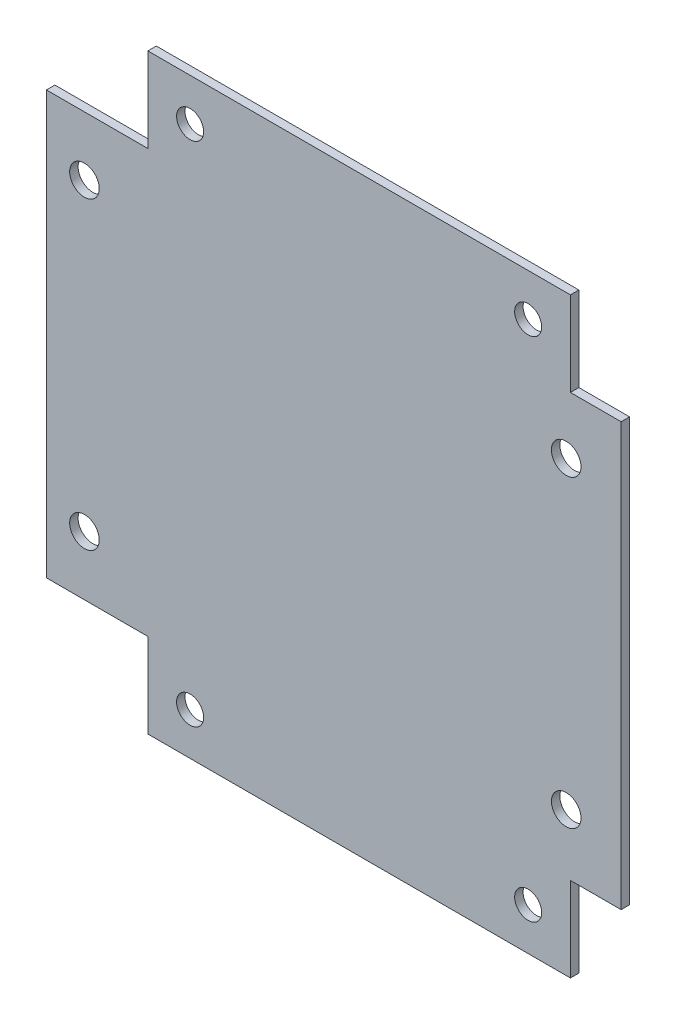
ISO-10303-21;
HEADER;
FILE_DESCRIPTION(('STEP AP214'),'2;1');
FILE_NAME('part.step','',(''),(''),'','','');
FILE_SCHEMA(('AUTOMOTIVE_DESIGN { 1 0 10303 214 1 1 1 1 }'));
ENDSEC;
DATA;
#1=APPLICATION_CONTEXT('core data for automotive mechanical design processes');
#2=APPLICATION_PROTOCOL_DEFINITION('international standard','automotive_design',2000,#1);
#3=PRODUCT_CONTEXT('',#1,'mechanical');
#4=PRODUCT('Part','Part','',(#3));
#5=PRODUCT_RELATED_PRODUCT_CATEGORY('part','',(#4));
#6=PRODUCT_DEFINITION_FORMATION('','',#4);
#7=PRODUCT_DEFINITION_CONTEXT('part definition',#1,'design');
#8=PRODUCT_DEFINITION('design','',#6,#7);
#9=PRODUCT_DEFINITION_SHAPE('','',#8);
#10=(LENGTH_UNIT() NAMED_UNIT(*) SI_UNIT(.MILLI.,.METRE.));
#11=(NAMED_UNIT(*) PLANE_ANGLE_UNIT() SI_UNIT($,.RADIAN.));
#12=(NAMED_UNIT(*) SI_UNIT($,.STERADIAN.) SOLID_ANGLE_UNIT());
#13=UNCERTAINTY_MEASURE_WITH_UNIT(LENGTH_MEASURE(1.E-05),#10,'distance_accuracy_value','');
#14=(GEOMETRIC_REPRESENTATION_CONTEXT(3) GLOBAL_UNCERTAINTY_ASSIGNED_CONTEXT((#13)) GLOBAL_UNIT_ASSIGNED_CONTEXT((#10,
#11,#12)) REPRESENTATION_CONTEXT('',''));
#15=CARTESIAN_POINT('',(0.,0.,0.));
#16=DIRECTION('',(0.,0.,1.));
#17=DIRECTION('',(1.,0.,0.));
#18=AXIS2_PLACEMENT_3D('',#15,#16,#17);
#19=CARTESIAN_POINT('',(28.,0.,1.));
#20=DIRECTION('',(0.,0.,1.));
#21=DIRECTION('',(1.,0.,0.));
#22=AXIS2_PLACEMENT_3D('',#19,#20,#21);
#23=PLANE('',#22);
#24=CARTESIAN_POINT('',(-20.,30.,1.));
#25=DIRECTION('',(0.,0.,1.));
#26=DIRECTION('',(1.,0.,0.));
#27=AXIS2_PLACEMENT_3D('',#24,#25,#26);
#28=CIRCLE('',#27,1.6);
#29=CARTESIAN_POINT('',(-18.4,30.,1.));
#30=VERTEX_POINT('',#29);
#31=EDGE_CURVE('E153',#30,#30,#28,.F.);
#32=ORIENTED_EDGE('',*,*,#31,.T.);
#33=EDGE_LOOP('',(#32));
#34=FACE_BOUND('',#33,.T.);
#35=CARTESIAN_POINT('',(20.,30.,1.));
#36=DIRECTION('',(0.,0.,1.));
#37=DIRECTION('',(1.,0.,0.));
#38=AXIS2_PLACEMENT_3D('',#35,#36,#37);
#39=CIRCLE('',#38,1.6);
#40=CARTESIAN_POINT('',(21.6,30.,1.));
#41=VERTEX_POINT('',#40);
#42=EDGE_CURVE('E156',#41,#41,#39,.F.);
#43=ORIENTED_EDGE('',*,*,#42,.T.);
#44=EDGE_LOOP('',(#43));
#45=FACE_BOUND('',#44,.T.);
#46=CARTESIAN_POINT('',(-20.,-30.,1.));
#47=DIRECTION('',(0.,0.,1.));
#48=DIRECTION('',(1.,0.,0.));
#49=AXIS2_PLACEMENT_3D('',#46,#47,#48);
#50=CIRCLE('',#49,1.6);
#51=CARTESIAN_POINT('',(-18.4,-30.,1.));
#52=VERTEX_POINT('',#51);
#53=EDGE_CURVE('E159',#52,#52,#50,.F.);
#54=ORIENTED_EDGE('',*,*,#53,.T.);
#55=EDGE_LOOP('',(#54));
#56=FACE_BOUND('',#55,.T.);
#57=CARTESIAN_POINT('',(20.,-30.,1.));
#58=DIRECTION('',(0.,0.,1.));
#59=DIRECTION('',(1.,0.,0.));
#60=AXIS2_PLACEMENT_3D('',#57,#58,#59);
#61=CIRCLE('',#60,1.6);
#62=CARTESIAN_POINT('',(21.6,-30.,1.));
#63=VERTEX_POINT('',#62);
#64=EDGE_CURVE('E162',#63,#63,#61,.F.);
#65=ORIENTED_EDGE('',*,*,#64,.T.);
#66=EDGE_LOOP('',(#65));
#67=FACE_BOUND('',#66,.T.);
#68=CARTESIAN_POINT('',(-32.5,-18.,1.));
#69=DIRECTION('',(0.,0.,-1.));
#70=DIRECTION('',(-1.,0.,0.));
#71=AXIS2_PLACEMENT_3D('',#68,#69,#70);
#72=CIRCLE('',#71,1.75);
#73=CARTESIAN_POINT('',(-34.25,-18.,1.));
#74=VERTEX_POINT('',#73);
#75=EDGE_CURVE('E165',#74,#74,#72,.T.);
#76=ORIENTED_EDGE('',*,*,#75,.T.);
#77=EDGE_LOOP('',(#76));
#78=FACE_BOUND('',#77,.T.);
#79=CARTESIAN_POINT('',(24.5,18.,1.));
#80=DIRECTION('',(0.,0.,-1.));
#81=DIRECTION('',(-1.,0.,0.));
#82=AXIS2_PLACEMENT_3D('',#79,#80,#81);
#83=CIRCLE('',#82,1.75);
#84=CARTESIAN_POINT('',(22.75,18.,1.));
#85=VERTEX_POINT('',#84);
#86=EDGE_CURVE('E168',#85,#85,#83,.T.);
#87=ORIENTED_EDGE('',*,*,#86,.T.);
#88=EDGE_LOOP('',(#87));
#89=FACE_BOUND('',#88,.T.);
#90=CARTESIAN_POINT('',(-32.5,18.,1.));
#91=DIRECTION('',(0.,0.,-1.));
#92=DIRECTION('',(-1.,0.,0.));
#93=AXIS2_PLACEMENT_3D('',#90,#91,#92);
#94=CIRCLE('',#93,1.75);
#95=CARTESIAN_POINT('',(-34.25,18.,1.));
#96=VERTEX_POINT('',#95);
#97=EDGE_CURVE('E170',#96,#96,#94,.T.);
#98=ORIENTED_EDGE('',*,*,#97,.T.);
#99=EDGE_LOOP('',(#98));
#100=FACE_BOUND('',#99,.T.);
#101=CARTESIAN_POINT('',(24.5,-18.,1.));
#102=DIRECTION('',(0.,0.,-1.));
#103=DIRECTION('',(-1.,0.,0.));
#104=AXIS2_PLACEMENT_3D('',#101,#102,#103);
#105=CIRCLE('',#104,1.75);
#106=CARTESIAN_POINT('',(22.75,-18.,1.));
#107=VERTEX_POINT('',#106);
#108=EDGE_CURVE('E19',#107,#107,#105,.T.);
#109=ORIENTED_EDGE('',*,*,#108,.T.);
#110=EDGE_LOOP('',(#109));
#111=FACE_BOUND('',#110,.T.);
#112=DIRECTION('',(1.,0.,0.));
#113=VECTOR('',#112,1.);
#114=CARTESIAN_POINT('',(25.,-35.,1.));
#115=LINE('',#114,#113);
#116=CARTESIAN_POINT('',(25.,-35.,1.));
#117=VERTEX_POINT('',#116);
#118=CARTESIAN_POINT('',(-25.,-35.,1.));
#119=VERTEX_POINT('',#118);
#120=EDGE_CURVE('E194',#117,#119,#115,.F.);
#121=ORIENTED_EDGE('',*,*,#120,.F.);
#122=DIRECTION('',(0.,1.,0.));
#123=VECTOR('',#122,1.);
#124=CARTESIAN_POINT('',(25.,35.,1.));
#125=LINE('',#124,#123);
#126=CARTESIAN_POINT('',(25.,-25.,1.));
#127=VERTEX_POINT('',#126);
#128=EDGE_CURVE('E190',#127,#117,#125,.F.);
#129=ORIENTED_EDGE('',*,*,#128,.F.);
#130=DIRECTION('',(1.,0.,0.));
#131=VECTOR('',#130,1.);
#132=CARTESIAN_POINT('',(31.,-25.,1.));
#133=LINE('',#132,#131);
#134=CARTESIAN_POINT('',(31.,-25.,1.));
#135=VERTEX_POINT('',#134);
#136=EDGE_CURVE('E186',#135,#127,#133,.F.);
#137=ORIENTED_EDGE('',*,*,#136,.F.);
#138=DIRECTION('',(0.,1.,0.));
#139=VECTOR('',#138,1.);
#140=CARTESIAN_POINT('',(31.,25.,1.));
#141=LINE('',#140,#139);
#142=CARTESIAN_POINT('',(31.,25.,1.));
#143=VERTEX_POINT('',#142);
#144=EDGE_CURVE('E113',#143,#135,#141,.F.);
#145=ORIENTED_EDGE('',*,*,#144,.F.);
#146=DIRECTION('',(1.,0.,0.));
#147=VECTOR('',#146,1.);
#148=CARTESIAN_POINT('',(25.,25.,1.));
#149=LINE('',#148,#147);
#150=CARTESIAN_POINT('',(25.,25.,1.));
#151=VERTEX_POINT('',#150);
#152=EDGE_CURVE('E107',#151,#143,#149,.T.);
#153=ORIENTED_EDGE('',*,*,#152,.F.);
#154=DIRECTION('',(0.,1.,0.));
#155=VECTOR('',#154,1.);
#156=CARTESIAN_POINT('',(25.,35.,1.));
#157=LINE('',#156,#155);
#158=CARTESIAN_POINT('',(25.,35.,1.));
#159=VERTEX_POINT('',#158);
#160=EDGE_CURVE('E110',#159,#151,#157,.F.);
#161=ORIENTED_EDGE('',*,*,#160,.F.);
#162=DIRECTION('',(1.,0.,0.));
#163=VECTOR('',#162,1.);
#164=CARTESIAN_POINT('',(-25.,35.,1.));
#165=LINE('',#164,#163);
#166=CARTESIAN_POINT('',(-25.,35.,1.));
#167=VERTEX_POINT('',#166);
#168=EDGE_CURVE('E102',#167,#159,#165,.T.);
#169=ORIENTED_EDGE('',*,*,#168,.F.);
#170=DIRECTION('',(0.,-1.,0.));
#171=VECTOR('',#170,1.);
#172=CARTESIAN_POINT('',(-25.,-25.,1.));
#173=LINE('',#172,#171);
#174=CARTESIAN_POINT('',(-25.,25.,1.));
#175=VERTEX_POINT('',#174);
#176=EDGE_CURVE('E215',#175,#167,#173,.F.);
#177=ORIENTED_EDGE('',*,*,#176,.F.);
#178=DIRECTION('',(1.,0.,0.));
#179=VECTOR('',#178,1.);
#180=CARTESIAN_POINT('',(-37.,25.,1.));
#181=LINE('',#180,#179);
#182=CARTESIAN_POINT('',(-37.,25.,1.));
#183=VERTEX_POINT('',#182);
#184=EDGE_CURVE('E211',#183,#175,#181,.T.);
#185=ORIENTED_EDGE('',*,*,#184,.F.);
#186=DIRECTION('',(0.,-1.,0.));
#187=VECTOR('',#186,1.);
#188=CARTESIAN_POINT('',(-37.,-25.,1.));
#189=LINE('',#188,#187);
#190=CARTESIAN_POINT('',(-37.,-25.,1.));
#191=VERTEX_POINT('',#190);
#192=EDGE_CURVE('E207',#191,#183,#189,.F.);
#193=ORIENTED_EDGE('',*,*,#192,.F.);
#194=DIRECTION('',(1.,0.,0.));
#195=VECTOR('',#194,1.);
#196=CARTESIAN_POINT('',(-25.,-25.,1.));
#197=LINE('',#196,#195);
#198=CARTESIAN_POINT('',(-25.,-25.,1.));
#199=VERTEX_POINT('',#198);
#200=EDGE_CURVE('E203',#199,#191,#197,.F.);
#201=ORIENTED_EDGE('',*,*,#200,.F.);
#202=DIRECTION('',(0.,-1.,0.));
#203=VECTOR('',#202,1.);
#204=CARTESIAN_POINT('',(-25.,-25.,1.));
#205=LINE('',#204,#203);
#206=EDGE_CURVE('E196',#119,#199,#205,.F.);
#207=ORIENTED_EDGE('',*,*,#206,.F.);
#208=EDGE_LOOP('',(#121,#129,#137,#145,#153,#161,#169,#177,#185,#193,#201,#207));
#209=FACE_BOUND('',#208,.T.);
#210=ADVANCED_FACE('F16',(#34,#45,#56,#67,#78,#89,#100,#111,#209),#23,.T.);
#211=CARTESIAN_POINT('',(25.,25.,0.));
#212=DIRECTION('',(0.,1.,0.));
#213=DIRECTION('',(0.,0.,1.));
#214=AXIS2_PLACEMENT_3D('',#211,#212,#213);
#215=PLANE('',#214);
#216=DIRECTION('',(1.,0.,0.));
#217=VECTOR('',#216,1.);
#218=CARTESIAN_POINT('',(28.,25.,0.));
#219=LINE('',#218,#217);
#220=CARTESIAN_POINT('',(31.,25.,0.));
#221=VERTEX_POINT('',#220);
#222=CARTESIAN_POINT('',(25.,25.,0.));
#223=VERTEX_POINT('',#222);
#224=EDGE_CURVE('E128',#221,#223,#219,.F.);
#225=ORIENTED_EDGE('',*,*,#224,.T.);
#226=DIRECTION('',(0.,0.,1.));
#227=VECTOR('',#226,1.);
#228=CARTESIAN_POINT('',(25.,25.,0.));
#229=LINE('',#228,#227);
#230=EDGE_CURVE('E118',#151,#223,#229,.F.);
#231=ORIENTED_EDGE('',*,*,#230,.F.);
#232=ORIENTED_EDGE('',*,*,#152,.T.);
#233=DIRECTION('',(0.,0.,1.));
#234=VECTOR('',#233,1.);
#235=CARTESIAN_POINT('',(31.,25.,0.));
#236=LINE('',#235,#234);
#237=EDGE_CURVE('E175',#221,#143,#236,.T.);
#238=ORIENTED_EDGE('',*,*,#237,.F.);
#239=EDGE_LOOP('',(#225,#231,#232,#238));
#240=FACE_BOUND('',#239,.T.);
#241=ADVANCED_FACE('F127',(#240),#215,.T.);
#242=CARTESIAN_POINT('',(25.,35.,0.));
#243=DIRECTION('',(1.,0.,0.));
#244=DIRECTION('',(0.,1.,0.));
#245=AXIS2_PLACEMENT_3D('',#242,#243,#244);
#246=PLANE('',#245);
#247=DIRECTION('',(0.,0.,1.));
#248=VECTOR('',#247,1.);
#249=CARTESIAN_POINT('',(25.,35.,0.));
#250=LINE('',#249,#248);
#251=CARTESIAN_POINT('',(25.,35.,0.));
#252=VERTEX_POINT('',#251);
#253=EDGE_CURVE('E124',#159,#252,#250,.F.);
#254=ORIENTED_EDGE('',*,*,#253,.F.);
#255=ORIENTED_EDGE('',*,*,#160,.T.);
#256=ORIENTED_EDGE('',*,*,#230,.T.);
#257=DIRECTION('',(0.,1.,0.));
#258=VECTOR('',#257,1.);
#259=CARTESIAN_POINT('',(25.,0.,0.));
#260=LINE('',#259,#258);
#261=EDGE_CURVE('E225',#223,#252,#260,.T.);
#262=ORIENTED_EDGE('',*,*,#261,.T.);
#263=EDGE_LOOP('',(#254,#255,#256,#262));
#264=FACE_BOUND('',#263,.T.);
#265=ADVANCED_FACE('F121',(#264),#246,.T.);
#266=CARTESIAN_POINT('',(-25.,35.,0.));
#267=DIRECTION('',(0.,1.,0.));
#268=DIRECTION('',(0.,0.,1.));
#269=AXIS2_PLACEMENT_3D('',#266,#267,#268);
#270=PLANE('',#269);
#271=DIRECTION('',(1.,0.,0.));
#272=VECTOR('',#271,1.);
#273=CARTESIAN_POINT('',(28.,35.,0.));
#274=LINE('',#273,#272);
#275=CARTESIAN_POINT('',(-25.,35.,0.));
#276=VERTEX_POINT('',#275);
#277=EDGE_CURVE('E220',#252,#276,#274,.F.);
#278=ORIENTED_EDGE('',*,*,#277,.T.);
#279=DIRECTION('',(0.,0.,1.));
#280=VECTOR('',#279,1.);
#281=CARTESIAN_POINT('',(-25.,35.,0.));
#282=LINE('',#281,#280);
#283=EDGE_CURVE('E213',#167,#276,#282,.F.);
#284=ORIENTED_EDGE('',*,*,#283,.F.);
#285=ORIENTED_EDGE('',*,*,#168,.T.);
#286=ORIENTED_EDGE('',*,*,#253,.T.);
#287=EDGE_LOOP('',(#278,#284,#285,#286));
#288=FACE_BOUND('',#287,.T.);
#289=ADVANCED_FACE('F219',(#288),#270,.T.);
#290=CARTESIAN_POINT('',(-25.,-25.,0.));
#291=DIRECTION('',(-1.,0.,0.));
#292=DIRECTION('',(0.,-1.,0.));
#293=AXIS2_PLACEMENT_3D('',#290,#291,#292);
#294=PLANE('',#293);
#295=ORIENTED_EDGE('',*,*,#283,.T.);
#296=DIRECTION('',(0.,1.,0.));
#297=VECTOR('',#296,1.);
#298=CARTESIAN_POINT('',(-25.,0.,0.));
#299=LINE('',#298,#297);
#300=CARTESIAN_POINT('',(-25.,25.,0.));
#301=VERTEX_POINT('',#300);
#302=EDGE_CURVE('E228',#276,#301,#299,.F.);
#303=ORIENTED_EDGE('',*,*,#302,.T.);
#304=DIRECTION('',(0.,0.,1.));
#305=VECTOR('',#304,1.);
#306=CARTESIAN_POINT('',(-25.,25.,0.));
#307=LINE('',#306,#305);
#308=EDGE_CURVE('E209',#175,#301,#307,.F.);
#309=ORIENTED_EDGE('',*,*,#308,.F.);
#310=ORIENTED_EDGE('',*,*,#176,.T.);
#311=EDGE_LOOP('',(#295,#303,#309,#310));
#312=FACE_BOUND('',#311,.T.);
#313=ADVANCED_FACE('F286',(#312),#294,.T.);
#314=CARTESIAN_POINT('',(-37.,25.,0.));
#315=DIRECTION('',(0.,1.,0.));
#316=DIRECTION('',(0.,0.,1.));
#317=AXIS2_PLACEMENT_3D('',#314,#315,#316);
#318=PLANE('',#317);
#319=DIRECTION('',(1.,0.,0.));
#320=VECTOR('',#319,1.);
#321=CARTESIAN_POINT('',(28.,25.,0.));
#322=LINE('',#321,#320);
#323=CARTESIAN_POINT('',(-37.,25.,0.));
#324=VERTEX_POINT('',#323);
#325=EDGE_CURVE('E232',#301,#324,#322,.F.);
#326=ORIENTED_EDGE('',*,*,#325,.T.);
#327=DIRECTION('',(0.,0.,1.));
#328=VECTOR('',#327,1.);
#329=CARTESIAN_POINT('',(-37.,25.,0.));
#330=LINE('',#329,#328);
#331=EDGE_CURVE('E205',#183,#324,#330,.F.);
#332=ORIENTED_EDGE('',*,*,#331,.F.);
#333=ORIENTED_EDGE('',*,*,#184,.T.);
#334=ORIENTED_EDGE('',*,*,#308,.T.);
#335=EDGE_LOOP('',(#326,#332,#333,#334));
#336=FACE_BOUND('',#335,.T.);
#337=ADVANCED_FACE('F282',(#336),#318,.T.);
#338=CARTESIAN_POINT('',(-37.,-25.,0.));
#339=DIRECTION('',(-1.,0.,0.));
#340=DIRECTION('',(0.,-1.,0.));
#341=AXIS2_PLACEMENT_3D('',#338,#339,#340);
#342=PLANE('',#341);
#343=DIRECTION('',(0.,1.,0.));
#344=VECTOR('',#343,1.);
#345=CARTESIAN_POINT('',(-37.,0.,0.));
#346=LINE('',#345,#344);
#347=CARTESIAN_POINT('',(-37.,-25.,0.));
#348=VERTEX_POINT('',#347);
#349=EDGE_CURVE('E235',#324,#348,#346,.F.);
#350=ORIENTED_EDGE('',*,*,#349,.T.);
#351=DIRECTION('',(0.,0.,-1.));
#352=VECTOR('',#351,1.);
#353=CARTESIAN_POINT('',(-37.,-25.,0.));
#354=LINE('',#353,#352);
#355=EDGE_CURVE('E201',#191,#348,#354,.T.);
#356=ORIENTED_EDGE('',*,*,#355,.F.);
#357=ORIENTED_EDGE('',*,*,#192,.T.);
#358=ORIENTED_EDGE('',*,*,#331,.T.);
#359=EDGE_LOOP('',(#350,#356,#357,#358));
#360=FACE_BOUND('',#359,.T.);
#361=ADVANCED_FACE('F278',(#360),#342,.T.);
#362=CARTESIAN_POINT('',(-25.,-25.,0.));
#363=DIRECTION('',(0.,-1.,0.));
#364=DIRECTION('',(0.,0.,-1.));
#365=AXIS2_PLACEMENT_3D('',#362,#363,#364);
#366=PLANE('',#365);
#367=DIRECTION('',(1.,0.,0.));
#368=VECTOR('',#367,1.);
#369=CARTESIAN_POINT('',(28.,-25.,0.));
#370=LINE('',#369,#368);
#371=CARTESIAN_POINT('',(-25.,-25.,0.));
#372=VERTEX_POINT('',#371);
#373=EDGE_CURVE('E238',#348,#372,#370,.T.);
#374=ORIENTED_EDGE('',*,*,#373,.T.);
#375=DIRECTION('',(0.,0.,1.));
#376=VECTOR('',#375,1.);
#377=CARTESIAN_POINT('',(-25.,-25.,0.));
#378=LINE('',#377,#376);
#379=EDGE_CURVE('E199',#199,#372,#378,.F.);
#380=ORIENTED_EDGE('',*,*,#379,.F.);
#381=ORIENTED_EDGE('',*,*,#200,.T.);
#382=ORIENTED_EDGE('',*,*,#355,.T.);
#383=EDGE_LOOP('',(#374,#380,#381,#382));
#384=FACE_BOUND('',#383,.T.);
#385=ADVANCED_FACE('F274',(#384),#366,.T.);
#386=CARTESIAN_POINT('',(-25.,-25.,0.));
#387=DIRECTION('',(-1.,0.,0.));
#388=DIRECTION('',(0.,-1.,0.));
#389=AXIS2_PLACEMENT_3D('',#386,#387,#388);
#390=PLANE('',#389);
#391=DIRECTION('',(0.,0.,1.));
#392=VECTOR('',#391,1.);
#393=CARTESIAN_POINT('',(-25.,-35.,0.));
#394=LINE('',#393,#392);
#395=CARTESIAN_POINT('',(-25.,-35.,0.));
#396=VERTEX_POINT('',#395);
#397=EDGE_CURVE('E192',#119,#396,#394,.F.);
#398=ORIENTED_EDGE('',*,*,#397,.F.);
#399=ORIENTED_EDGE('',*,*,#206,.T.);
#400=ORIENTED_EDGE('',*,*,#379,.T.);
#401=DIRECTION('',(0.,1.,0.));
#402=VECTOR('',#401,1.);
#403=CARTESIAN_POINT('',(-25.,0.,0.));
#404=LINE('',#403,#402);
#405=EDGE_CURVE('E241',#372,#396,#404,.F.);
#406=ORIENTED_EDGE('',*,*,#405,.T.);
#407=EDGE_LOOP('',(#398,#399,#400,#406));
#408=FACE_BOUND('',#407,.T.);
#409=ADVANCED_FACE('F269',(#408),#390,.T.);
#410=CARTESIAN_POINT('',(25.,-35.,0.));
#411=DIRECTION('',(0.,-1.,0.));
#412=DIRECTION('',(1.,0.,0.));
#413=AXIS2_PLACEMENT_3D('',#410,#411,#412);
#414=PLANE('',#413);
#415=DIRECTION('',(1.,0.,0.));
#416=VECTOR('',#415,1.);
#417=CARTESIAN_POINT('',(28.,-35.,0.));
#418=LINE('',#417,#416);
#419=CARTESIAN_POINT('',(25.,-35.,0.));
#420=VERTEX_POINT('',#419);
#421=EDGE_CURVE('E244',#396,#420,#418,.T.);
#422=ORIENTED_EDGE('',*,*,#421,.T.);
#423=DIRECTION('',(0.,0.,1.));
#424=VECTOR('',#423,1.);
#425=CARTESIAN_POINT('',(25.,-35.,0.));
#426=LINE('',#425,#424);
#427=EDGE_CURVE('E188',#117,#420,#426,.F.);
#428=ORIENTED_EDGE('',*,*,#427,.F.);
#429=ORIENTED_EDGE('',*,*,#120,.T.);
#430=ORIENTED_EDGE('',*,*,#397,.T.);
#431=EDGE_LOOP('',(#422,#428,#429,#430));
#432=FACE_BOUND('',#431,.T.);
#433=ADVANCED_FACE('F265',(#432),#414,.T.);
#434=CARTESIAN_POINT('',(25.,35.,0.));
#435=DIRECTION('',(1.,0.,0.));
#436=DIRECTION('',(0.,1.,0.));
#437=AXIS2_PLACEMENT_3D('',#434,#435,#436);
#438=PLANE('',#437);
#439=ORIENTED_EDGE('',*,*,#427,.T.);
#440=DIRECTION('',(0.,1.,0.));
#441=VECTOR('',#440,1.);
#442=CARTESIAN_POINT('',(25.,0.,0.));
#443=LINE('',#442,#441);
#444=CARTESIAN_POINT('',(25.,-25.,0.));
#445=VERTEX_POINT('',#444);
#446=EDGE_CURVE('E247',#420,#445,#443,.T.);
#447=ORIENTED_EDGE('',*,*,#446,.T.);
#448=DIRECTION('',(0.,0.,1.));
#449=VECTOR('',#448,1.);
#450=CARTESIAN_POINT('',(25.,-25.,0.));
#451=LINE('',#450,#449);
#452=EDGE_CURVE('E184',#127,#445,#451,.F.);
#453=ORIENTED_EDGE('',*,*,#452,.F.);
#454=ORIENTED_EDGE('',*,*,#128,.T.);
#455=EDGE_LOOP('',(#439,#447,#453,#454));
#456=FACE_BOUND('',#455,.T.);
#457=ADVANCED_FACE('F260',(#456),#438,.T.);
#458=CARTESIAN_POINT('',(31.,-25.,0.));
#459=DIRECTION('',(0.,-1.,0.));
#460=DIRECTION('',(1.,0.,0.));
#461=AXIS2_PLACEMENT_3D('',#458,#459,#460);
#462=PLANE('',#461);
#463=DIRECTION('',(1.,0.,0.));
#464=VECTOR('',#463,1.);
#465=CARTESIAN_POINT('',(28.,-25.,0.));
#466=LINE('',#465,#464);
#467=CARTESIAN_POINT('',(31.,-25.,0.));
#468=VERTEX_POINT('',#467);
#469=EDGE_CURVE('E250',#445,#468,#466,.T.);
#470=ORIENTED_EDGE('',*,*,#469,.T.);
#471=DIRECTION('',(0.,0.,1.));
#472=VECTOR('',#471,1.);
#473=CARTESIAN_POINT('',(31.,-25.,0.));
#474=LINE('',#473,#472);
#475=EDGE_CURVE('E34',#135,#468,#474,.F.);
#476=ORIENTED_EDGE('',*,*,#475,.F.);
#477=ORIENTED_EDGE('',*,*,#136,.T.);
#478=ORIENTED_EDGE('',*,*,#452,.T.);
#479=EDGE_LOOP('',(#470,#476,#477,#478));
#480=FACE_BOUND('',#479,.T.);
#481=ADVANCED_FACE('F256',(#480),#462,.T.);
#482=CARTESIAN_POINT('',(31.,25.,0.));
#483=DIRECTION('',(1.,0.,0.));
#484=DIRECTION('',(0.,1.,0.));
#485=AXIS2_PLACEMENT_3D('',#482,#483,#484);
#486=PLANE('',#485);
#487=DIRECTION('',(0.,1.,0.));
#488=VECTOR('',#487,1.);
#489=CARTESIAN_POINT('',(31.,0.,0.));
#490=LINE('',#489,#488);
#491=EDGE_CURVE('E152',#468,#221,#490,.T.);
#492=ORIENTED_EDGE('',*,*,#491,.T.);
#493=ORIENTED_EDGE('',*,*,#237,.T.);
#494=ORIENTED_EDGE('',*,*,#144,.T.);
#495=ORIENTED_EDGE('',*,*,#475,.T.);
#496=EDGE_LOOP('',(#492,#493,#494,#495));
#497=FACE_BOUND('',#496,.T.);
#498=ADVANCED_FACE('F253',(#497),#486,.T.);
#499=CARTESIAN_POINT('',(24.5,-18.,1.));
#500=DIRECTION('',(0.,0.,-1.));
#501=DIRECTION('',(-1.,0.,0.));
#502=AXIS2_PLACEMENT_3D('',#499,#500,#501);
#503=CYLINDRICAL_SURFACE('',#502,1.75);
#504=CARTESIAN_POINT('',(24.5,-18.,0.));
#505=DIRECTION('',(0.,0.,-1.));
#506=DIRECTION('',(-1.,0.,0.));
#507=AXIS2_PLACEMENT_3D('',#504,#505,#506);
#508=CIRCLE('',#507,1.75);
#509=CARTESIAN_POINT('',(22.75,-18.,0.));
#510=VERTEX_POINT('',#509);
#511=EDGE_CURVE('E149',#510,#510,#508,.T.);
#512=ORIENTED_EDGE('',*,*,#511,.T.);
#513=EDGE_LOOP('',(#512));
#514=FACE_BOUND('',#513,.T.);
#515=ORIENTED_EDGE('',*,*,#108,.F.);
#516=EDGE_LOOP('',(#515));
#517=FACE_BOUND('',#516,.T.);
#518=ADVANCED_FACE('F331',(#514,#517),#503,.F.);
#519=CARTESIAN_POINT('',(-32.5,18.,1.));
#520=DIRECTION('',(0.,0.,-1.));
#521=DIRECTION('',(-1.,0.,0.));
#522=AXIS2_PLACEMENT_3D('',#519,#520,#521);
#523=CYLINDRICAL_SURFACE('',#522,1.75);
#524=CARTESIAN_POINT('',(-32.5,18.,0.));
#525=DIRECTION('',(0.,0.,-1.));
#526=DIRECTION('',(-1.,0.,0.));
#527=AXIS2_PLACEMENT_3D('',#524,#525,#526);
#528=CIRCLE('',#527,1.75);
#529=CARTESIAN_POINT('',(-34.25,18.,0.));
#530=VERTEX_POINT('',#529);
#531=EDGE_CURVE('E146',#530,#530,#528,.T.);
#532=ORIENTED_EDGE('',*,*,#531,.T.);
#533=EDGE_LOOP('',(#532));
#534=FACE_BOUND('',#533,.T.);
#535=ORIENTED_EDGE('',*,*,#97,.F.);
#536=EDGE_LOOP('',(#535));
#537=FACE_BOUND('',#536,.T.);
#538=ADVANCED_FACE('F327',(#534,#537),#523,.F.);
#539=CARTESIAN_POINT('',(24.5,18.,1.));
#540=DIRECTION('',(0.,0.,-1.));
#541=DIRECTION('',(-1.,0.,0.));
#542=AXIS2_PLACEMENT_3D('',#539,#540,#541);
#543=CYLINDRICAL_SURFACE('',#542,1.75);
#544=CARTESIAN_POINT('',(24.5,18.,0.));
#545=DIRECTION('',(0.,0.,-1.));
#546=DIRECTION('',(-1.,0.,0.));
#547=AXIS2_PLACEMENT_3D('',#544,#545,#546);
#548=CIRCLE('',#547,1.75);
#549=CARTESIAN_POINT('',(22.75,18.,0.));
#550=VERTEX_POINT('',#549);
#551=EDGE_CURVE('E143',#550,#550,#548,.T.);
#552=ORIENTED_EDGE('',*,*,#551,.T.);
#553=EDGE_LOOP('',(#552));
#554=FACE_BOUND('',#553,.T.);
#555=ORIENTED_EDGE('',*,*,#86,.F.);
#556=EDGE_LOOP('',(#555));
#557=FACE_BOUND('',#556,.T.);
#558=ADVANCED_FACE('F323',(#554,#557),#543,.F.);
#559=CARTESIAN_POINT('',(-32.5,-18.,1.));
#560=DIRECTION('',(0.,0.,-1.));
#561=DIRECTION('',(-1.,0.,0.));
#562=AXIS2_PLACEMENT_3D('',#559,#560,#561);
#563=CYLINDRICAL_SURFACE('',#562,1.75);
#564=CARTESIAN_POINT('',(-32.5,-18.,0.));
#565=DIRECTION('',(0.,0.,-1.));
#566=DIRECTION('',(-1.,0.,0.));
#567=AXIS2_PLACEMENT_3D('',#564,#565,#566);
#568=CIRCLE('',#567,1.75);
#569=CARTESIAN_POINT('',(-34.25,-18.,0.));
#570=VERTEX_POINT('',#569);
#571=EDGE_CURVE('E140',#570,#570,#568,.T.);
#572=ORIENTED_EDGE('',*,*,#571,.T.);
#573=EDGE_LOOP('',(#572));
#574=FACE_BOUND('',#573,.T.);
#575=ORIENTED_EDGE('',*,*,#75,.F.);
#576=EDGE_LOOP('',(#575));
#577=FACE_BOUND('',#576,.T.);
#578=ADVANCED_FACE('F319',(#574,#577),#563,.F.);
#579=CARTESIAN_POINT('',(20.,-30.,0.));
#580=DIRECTION('',(0.,0.,1.));
#581=DIRECTION('',(1.,0.,0.));
#582=AXIS2_PLACEMENT_3D('',#579,#580,#581);
#583=CYLINDRICAL_SURFACE('',#582,1.6);
#584=ORIENTED_EDGE('',*,*,#64,.F.);
#585=EDGE_LOOP('',(#584));
#586=FACE_BOUND('',#585,.T.);
#587=CARTESIAN_POINT('',(20.,-30.,0.));
#588=DIRECTION('',(0.,0.,1.));
#589=DIRECTION('',(1.,0.,0.));
#590=AXIS2_PLACEMENT_3D('',#587,#588,#589);
#591=CIRCLE('',#590,1.6);
#592=CARTESIAN_POINT('',(21.6,-30.,0.));
#593=VERTEX_POINT('',#592);
#594=EDGE_CURVE('E137',#593,#593,#591,.F.);
#595=ORIENTED_EDGE('',*,*,#594,.T.);
#596=EDGE_LOOP('',(#595));
#597=FACE_BOUND('',#596,.T.);
#598=ADVANCED_FACE('F315',(#586,#597),#583,.F.);
#599=CARTESIAN_POINT('',(-20.,-30.,0.));
#600=DIRECTION('',(0.,0.,1.));
#601=DIRECTION('',(1.,0.,0.));
#602=AXIS2_PLACEMENT_3D('',#599,#600,#601);
#603=CYLINDRICAL_SURFACE('',#602,1.6);
#604=ORIENTED_EDGE('',*,*,#53,.F.);
#605=EDGE_LOOP('',(#604));
#606=FACE_BOUND('',#605,.T.);
#607=CARTESIAN_POINT('',(-20.,-30.,0.));
#608=DIRECTION('',(0.,0.,1.));
#609=DIRECTION('',(1.,0.,0.));
#610=AXIS2_PLACEMENT_3D('',#607,#608,#609);
#611=CIRCLE('',#610,1.6);
#612=CARTESIAN_POINT('',(-18.4,-30.,0.));
#613=VERTEX_POINT('',#612);
#614=EDGE_CURVE('E134',#613,#613,#611,.F.);
#615=ORIENTED_EDGE('',*,*,#614,.T.);
#616=EDGE_LOOP('',(#615));
#617=FACE_BOUND('',#616,.T.);
#618=ADVANCED_FACE('F311',(#606,#617),#603,.F.);
#619=CARTESIAN_POINT('',(20.,30.,0.));
#620=DIRECTION('',(0.,0.,1.));
#621=DIRECTION('',(1.,0.,0.));
#622=AXIS2_PLACEMENT_3D('',#619,#620,#621);
#623=CYLINDRICAL_SURFACE('',#622,1.6);
#624=ORIENTED_EDGE('',*,*,#42,.F.);
#625=EDGE_LOOP('',(#624));
#626=FACE_BOUND('',#625,.T.);
#627=CARTESIAN_POINT('',(20.,30.,0.));
#628=DIRECTION('',(0.,0.,1.));
#629=DIRECTION('',(1.,0.,0.));
#630=AXIS2_PLACEMENT_3D('',#627,#628,#629);
#631=CIRCLE('',#630,1.6);
#632=CARTESIAN_POINT('',(21.6,30.,0.));
#633=VERTEX_POINT('',#632);
#634=EDGE_CURVE('E25',#633,#633,#631,.F.);
#635=ORIENTED_EDGE('',*,*,#634,.T.);
#636=EDGE_LOOP('',(#635));
#637=FACE_BOUND('',#636,.T.);
#638=ADVANCED_FACE('F303',(#626,#637),#623,.F.);
#639=CARTESIAN_POINT('',(-20.,30.,0.));
#640=DIRECTION('',(0.,0.,1.));
#641=DIRECTION('',(1.,0.,0.));
#642=AXIS2_PLACEMENT_3D('',#639,#640,#641);
#643=CYLINDRICAL_SURFACE('',#642,1.6);
#644=ORIENTED_EDGE('',*,*,#31,.F.);
#645=EDGE_LOOP('',(#644));
#646=FACE_BOUND('',#645,.T.);
#647=CARTESIAN_POINT('',(-20.,30.,0.));
#648=DIRECTION('',(0.,0.,1.));
#649=DIRECTION('',(1.,0.,0.));
#650=AXIS2_PLACEMENT_3D('',#647,#648,#649);
#651=CIRCLE('',#650,1.6);
#652=CARTESIAN_POINT('',(-18.4,30.,0.));
#653=VERTEX_POINT('',#652);
#654=EDGE_CURVE('E11',#653,#653,#651,.F.);
#655=ORIENTED_EDGE('',*,*,#654,.T.);
#656=EDGE_LOOP('',(#655));
#657=FACE_BOUND('',#656,.T.);
#658=ADVANCED_FACE('F297',(#646,#657),#643,.F.);
#659=CARTESIAN_POINT('',(28.,0.,0.));
#660=DIRECTION('',(0.,0.,1.));
#661=DIRECTION('',(1.,0.,0.));
#662=AXIS2_PLACEMENT_3D('',#659,#660,#661);
#663=PLANE('',#662);
#664=ORIENTED_EDGE('',*,*,#654,.F.);
#665=EDGE_LOOP('',(#664));
#666=FACE_BOUND('',#665,.T.);
#667=ORIENTED_EDGE('',*,*,#634,.F.);
#668=EDGE_LOOP('',(#667));
#669=FACE_BOUND('',#668,.T.);
#670=ORIENTED_EDGE('',*,*,#614,.F.);
#671=EDGE_LOOP('',(#670));
#672=FACE_BOUND('',#671,.T.);
#673=ORIENTED_EDGE('',*,*,#594,.F.);
#674=EDGE_LOOP('',(#673));
#675=FACE_BOUND('',#674,.T.);
#676=ORIENTED_EDGE('',*,*,#571,.F.);
#677=EDGE_LOOP('',(#676));
#678=FACE_BOUND('',#677,.T.);
#679=ORIENTED_EDGE('',*,*,#551,.F.);
#680=EDGE_LOOP('',(#679));
#681=FACE_BOUND('',#680,.T.);
#682=ORIENTED_EDGE('',*,*,#531,.F.);
#683=EDGE_LOOP('',(#682));
#684=FACE_BOUND('',#683,.T.);
#685=ORIENTED_EDGE('',*,*,#511,.F.);
#686=EDGE_LOOP('',(#685));
#687=FACE_BOUND('',#686,.T.);
#688=ORIENTED_EDGE('',*,*,#469,.F.);
#689=ORIENTED_EDGE('',*,*,#446,.F.);
#690=ORIENTED_EDGE('',*,*,#421,.F.);
#691=ORIENTED_EDGE('',*,*,#405,.F.);
#692=ORIENTED_EDGE('',*,*,#373,.F.);
#693=ORIENTED_EDGE('',*,*,#349,.F.);
#694=ORIENTED_EDGE('',*,*,#325,.F.);
#695=ORIENTED_EDGE('',*,*,#302,.F.);
#696=ORIENTED_EDGE('',*,*,#277,.F.);
#697=ORIENTED_EDGE('',*,*,#261,.F.);
#698=ORIENTED_EDGE('',*,*,#224,.F.);
#699=ORIENTED_EDGE('',*,*,#491,.F.);
#700=EDGE_LOOP('',(#688,#689,#690,#691,#692,#693,#694,#695,#696,#697,#698,#699));
#701=FACE_BOUND('',#700,.T.);
#702=ADVANCED_FACE('F224',(#666,#669,#672,#675,#678,#681,#684,#687,#701),#663,.F.);
#703=CLOSED_SHELL('',(#210,#241,#265,#289,#313,#337,#361,#385,#409,#433,#457,#481,#498,#518,
#538,#558,#578,#598,#618,#638,#658,#702));
#704=MANIFOLD_SOLID_BREP('B1',#703);
#705=ADVANCED_BREP_SHAPE_REPRESENTATION('',(#18,#704),#14);
#706=SHAPE_DEFINITION_REPRESENTATION(#9,#705);
ENDSEC;
END-ISO-10303-21;
